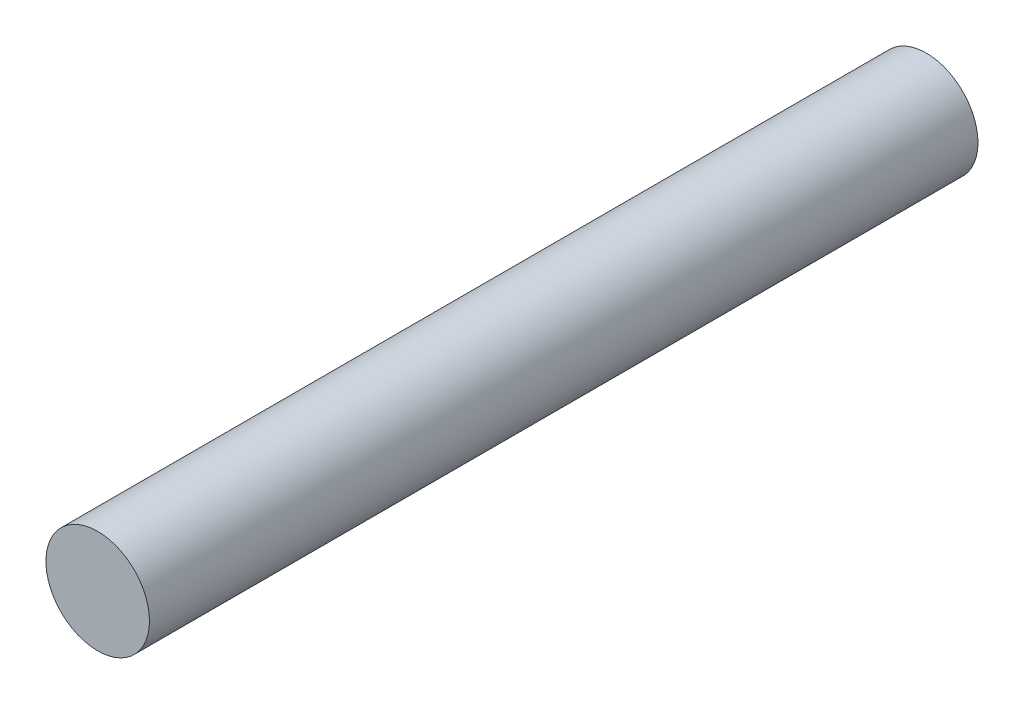
ISO-10303-21;
HEADER;
FILE_DESCRIPTION(('STEP AP214'),'2;1');
FILE_NAME('part.step','',(''),(''),'','','');
FILE_SCHEMA(('AUTOMOTIVE_DESIGN { 1 0 10303 214 1 1 1 1 }'));
ENDSEC;
DATA;
#1=APPLICATION_CONTEXT('core data for automotive mechanical design processes');
#2=APPLICATION_PROTOCOL_DEFINITION('international standard','automotive_design',2000,#1);
#3=PRODUCT_CONTEXT('',#1,'mechanical');
#4=PRODUCT('Part','Part','',(#3));
#5=PRODUCT_RELATED_PRODUCT_CATEGORY('part','',(#4));
#6=PRODUCT_DEFINITION_FORMATION('','',#4);
#7=PRODUCT_DEFINITION_CONTEXT('part definition',#1,'design');
#8=PRODUCT_DEFINITION('design','',#6,#7);
#9=PRODUCT_DEFINITION_SHAPE('','',#8);
#10=(LENGTH_UNIT() NAMED_UNIT(*) SI_UNIT(.MILLI.,.METRE.));
#11=(NAMED_UNIT(*) PLANE_ANGLE_UNIT() SI_UNIT($,.RADIAN.));
#12=(NAMED_UNIT(*) SI_UNIT($,.STERADIAN.) SOLID_ANGLE_UNIT());
#13=UNCERTAINTY_MEASURE_WITH_UNIT(LENGTH_MEASURE(1.E-05),#10,'distance_accuracy_value','');
#14=(GEOMETRIC_REPRESENTATION_CONTEXT(3) GLOBAL_UNCERTAINTY_ASSIGNED_CONTEXT((#13)) GLOBAL_UNIT_ASSIGNED_CONTEXT((#10,
#11,#12)) REPRESENTATION_CONTEXT('',''));
#15=CARTESIAN_POINT('',(0.,0.,0.));
#16=DIRECTION('',(0.,0.,1.));
#17=DIRECTION('',(1.,0.,0.));
#18=AXIS2_PLACEMENT_3D('',#15,#16,#17);
#19=CARTESIAN_POINT('',(0.,0.,16.));
#20=DIRECTION('',(0.,0.,-1.));
#21=DIRECTION('',(-1.,0.,0.));
#22=AXIS2_PLACEMENT_3D('',#19,#20,#21);
#23=CYLINDRICAL_SURFACE('',#22,1.);
#24=CARTESIAN_POINT('',(0.,0.,16.));
#25=DIRECTION('',(0.,0.,1.));
#26=DIRECTION('',(1.,0.,0.));
#27=AXIS2_PLACEMENT_3D('',#24,#25,#26);
#28=CIRCLE('',#27,1.);
#29=CARTESIAN_POINT('',(1.,0.,16.));
#30=VERTEX_POINT('',#29);
#31=EDGE_CURVE('E10',#30,#30,#28,.T.);
#32=ORIENTED_EDGE('',*,*,#31,.F.);
#33=EDGE_LOOP('',(#32));
#34=FACE_BOUND('',#33,.T.);
#35=CARTESIAN_POINT('',(0.,0.,0.));
#36=DIRECTION('',(0.,0.,1.));
#37=DIRECTION('',(1.,0.,0.));
#38=AXIS2_PLACEMENT_3D('',#35,#36,#37);
#39=CIRCLE('',#38,1.);
#40=CARTESIAN_POINT('',(1.,0.,0.));
#41=VERTEX_POINT('',#40);
#42=EDGE_CURVE('E40',#41,#41,#39,.T.);
#43=ORIENTED_EDGE('',*,*,#42,.T.);
#44=EDGE_LOOP('',(#43));
#45=FACE_BOUND('',#44,.T.);
#46=ADVANCED_FACE('F37',(#34,#45),#23,.T.);
#47=CARTESIAN_POINT('',(0.,0.,16.));
#48=DIRECTION('',(0.,0.,1.));
#49=DIRECTION('',(1.,0.,0.));
#50=AXIS2_PLACEMENT_3D('',#47,#48,#49);
#51=PLANE('',#50);
#52=ORIENTED_EDGE('',*,*,#31,.T.);
#53=EDGE_LOOP('',(#52));
#54=FACE_BOUND('',#53,.T.);
#55=ADVANCED_FACE('F52',(#54),#51,.T.);
#56=CARTESIAN_POINT('',(0.,0.,0.));
#57=DIRECTION('',(0.,0.,1.));
#58=DIRECTION('',(1.,0.,0.));
#59=AXIS2_PLACEMENT_3D('',#56,#57,#58);
#60=PLANE('',#59);
#61=ORIENTED_EDGE('',*,*,#42,.F.);
#62=EDGE_LOOP('',(#61));
#63=FACE_BOUND('',#62,.T.);
#64=ADVANCED_FACE('F50',(#63),#60,.F.);
#65=CLOSED_SHELL('',(#46,#55,#64));
#66=MANIFOLD_SOLID_BREP('B2',#65);
#67=ADVANCED_BREP_SHAPE_REPRESENTATION('',(#18,#66),#14);
#68=SHAPE_DEFINITION_REPRESENTATION(#9,#67);
ENDSEC;
END-ISO-10303-21;
